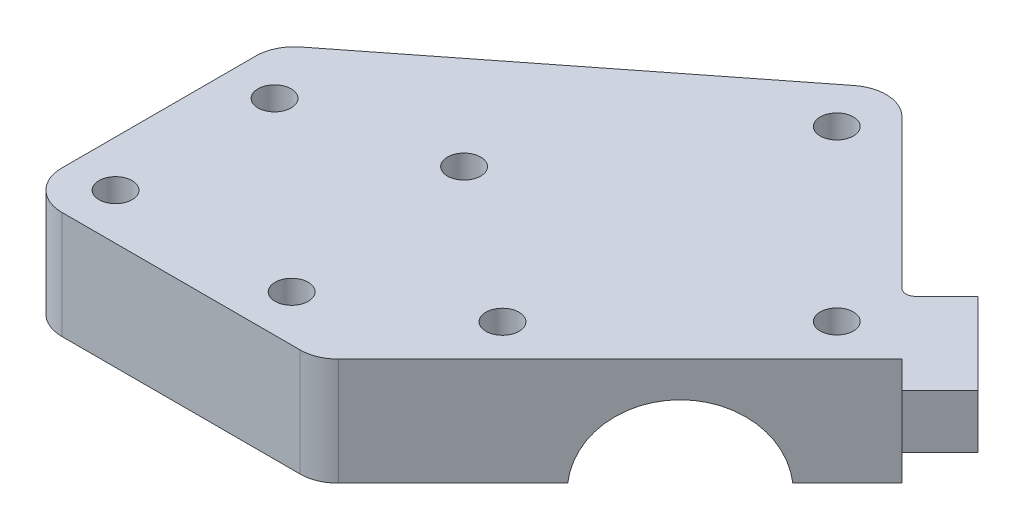
ISO-10303-21;
HEADER;
FILE_DESCRIPTION(('STEP AP214'),'2;1');
FILE_NAME('part.step','',(''),(''),'','','');
FILE_SCHEMA(('AUTOMOTIVE_DESIGN { 1 0 10303 214 1 1 1 1 }'));
ENDSEC;
DATA;
#1=APPLICATION_CONTEXT('core data for automotive mechanical design processes');
#2=APPLICATION_PROTOCOL_DEFINITION('international standard','automotive_design',2000,#1);
#3=PRODUCT_CONTEXT('',#1,'mechanical');
#4=PRODUCT('Part','Part','',(#3));
#5=PRODUCT_RELATED_PRODUCT_CATEGORY('part','',(#4));
#6=PRODUCT_DEFINITION_FORMATION('','',#4);
#7=PRODUCT_DEFINITION_CONTEXT('part definition',#1,'design');
#8=PRODUCT_DEFINITION('design','',#6,#7);
#9=PRODUCT_DEFINITION_SHAPE('','',#8);
#10=(LENGTH_UNIT() NAMED_UNIT(*) SI_UNIT(.MILLI.,.METRE.));
#11=(NAMED_UNIT(*) PLANE_ANGLE_UNIT() SI_UNIT($,.RADIAN.));
#12=(NAMED_UNIT(*) SI_UNIT($,.STERADIAN.) SOLID_ANGLE_UNIT());
#13=UNCERTAINTY_MEASURE_WITH_UNIT(LENGTH_MEASURE(1.E-05),#10,'distance_accuracy_value','');
#14=(GEOMETRIC_REPRESENTATION_CONTEXT(3) GLOBAL_UNCERTAINTY_ASSIGNED_CONTEXT((#13)) GLOBAL_UNIT_ASSIGNED_CONTEXT((#10,
#11,#12)) REPRESENTATION_CONTEXT('',''));
#15=CARTESIAN_POINT('',(0.,0.,0.));
#16=DIRECTION('',(0.,0.,1.));
#17=DIRECTION('',(1.,0.,0.));
#18=AXIS2_PLACEMENT_3D('',#15,#16,#17);
#19=CARTESIAN_POINT('',(-41.0289321881345,15.,-16.3499999999999));
#20=DIRECTION('',(-0.617406762156341,0.,-0.78664406820596));
#21=DIRECTION('',(-0.78664406820596,0.,0.617406762156341));
#22=AXIS2_PLACEMENT_3D('',#19,#20,#21);
#23=PLANE('',#22);
#24=DIRECTION('',(0.78664406820596,0.,-0.617406762156341));
#25=VECTOR('',#24,1.);
#26=CARTESIAN_POINT('',(-41.0289321881345,1.,-16.3499999999999));
#27=LINE('',#26,#25);
#28=CARTESIAN_POINT('',(-39.1159659989162,1.,-17.8514138016617));
#29=VERTEX_POINT('',#28);
#30=CARTESIAN_POINT('',(1.25585463277242,1.,-49.5377075983135));
#31=VERTEX_POINT('',#30);
#32=EDGE_CURVE('E229',#29,#31,#27,.T.);
#33=ORIENTED_EDGE('',*,*,#32,.F.);
#34=DIRECTION('',(0.,-1.,0.));
#35=VECTOR('',#34,1.);
#36=CARTESIAN_POINT('',(-39.1159659989162,15.,-17.8514138016617));
#37=LINE('',#36,#35);
#38=CARTESIAN_POINT('',(-39.1159659989162,15.,-17.8514138016617));
#39=VERTEX_POINT('',#38);
#40=EDGE_CURVE('E299',#29,#39,#37,.F.);
#41=ORIENTED_EDGE('',*,*,#40,.T.);
#42=DIRECTION('',(0.78664406820596,0.,-0.617406762156341));
#43=VECTOR('',#42,1.);
#44=CARTESIAN_POINT('',(-41.0289321881345,15.,-16.3499999999999));
#45=LINE('',#44,#43);
#46=CARTESIAN_POINT('',(1.25585463277242,15.,-49.5377075983135));
#47=VERTEX_POINT('',#46);
#48=EDGE_CURVE('E234',#39,#47,#45,.T.);
#49=ORIENTED_EDGE('',*,*,#48,.T.);
#50=DIRECTION('',(0.,-1.,0.));
#51=VECTOR('',#50,1.);
#52=CARTESIAN_POINT('',(1.25585463277243,15.,-49.5377075983135));
#53=LINE('',#52,#51);
#54=EDGE_CURVE('E296',#47,#31,#53,.T.);
#55=ORIENTED_EDGE('',*,*,#54,.T.);
#56=EDGE_LOOP('',(#33,#41,#49,#55));
#57=FACE_BOUND('',#56,.T.);
#58=ADVANCED_FACE('F36',(#57),#23,.T.);
#59=CARTESIAN_POINT('',(-41.0289321881345,15.,16.35));
#60=DIRECTION('',(-1.,0.,0.));
#61=DIRECTION('',(0.,0.,1.));
#62=AXIS2_PLACEMENT_3D('',#59,#60,#61);
#63=PLANE('',#62);
#64=DIRECTION('',(0.,0.,-1.));
#65=VECTOR('',#64,1.);
#66=CARTESIAN_POINT('',(-41.0289321881345,1.,16.35));
#67=LINE('',#66,#65);
#68=CARTESIAN_POINT('',(-41.0289321881345,1.,11.35));
#69=VERTEX_POINT('',#68);
#70=CARTESIAN_POINT('',(-41.0289321881345,1.,6.27076550350908));
#71=VERTEX_POINT('',#70);
#72=EDGE_CURVE('E187',#69,#71,#67,.T.);
#73=ORIENTED_EDGE('',*,*,#72,.F.);
#74=DIRECTION('',(0.,-1.,0.));
#75=VECTOR('',#74,1.);
#76=CARTESIAN_POINT('',(-41.0289321881345,15.,11.35));
#77=LINE('',#76,#75);
#78=CARTESIAN_POINT('',(-41.0289321881345,15.,11.35));
#79=VERTEX_POINT('',#78);
#80=EDGE_CURVE('E294',#69,#79,#77,.F.);
#81=ORIENTED_EDGE('',*,*,#80,.T.);
#82=DIRECTION('',(0.,0.,-1.));
#83=VECTOR('',#82,1.);
#84=CARTESIAN_POINT('',(-41.0289321881345,15.,16.35));
#85=LINE('',#84,#83);
#86=CARTESIAN_POINT('',(-41.0289321881345,15.,-13.9181934606319));
#87=VERTEX_POINT('',#86);
#88=EDGE_CURVE('E246',#79,#87,#85,.T.);
#89=ORIENTED_EDGE('',*,*,#88,.T.);
#90=DIRECTION('',(0.,-1.,0.));
#91=VECTOR('',#90,1.);
#92=CARTESIAN_POINT('',(-41.0289321881345,15.,-13.9181934606319));
#93=LINE('',#92,#91);
#94=CARTESIAN_POINT('',(-41.0289321881345,1.,-13.9181934606319));
#95=VERTEX_POINT('',#94);
#96=EDGE_CURVE('E291',#87,#95,#93,.T.);
#97=ORIENTED_EDGE('',*,*,#96,.T.);
#98=CARTESIAN_POINT('',(-41.0289321881345,0.999999999999998,-6.27076550350907));
#99=VERTEX_POINT('',#98);
#100=EDGE_CURVE('E262',#99,#95,#67,.T.);
#101=ORIENTED_EDGE('',*,*,#100,.F.);
#102=CARTESIAN_POINT('',(-41.0289321881345,0.,0.));
#103=DIRECTION('',(-1.,0.,0.));
#104=DIRECTION('',(0.,0.,1.));
#105=AXIS2_PLACEMENT_3D('',#102,#103,#104);
#106=CIRCLE('',#105,6.34999999999995);
#107=EDGE_CURVE('E179',#71,#99,#106,.T.);
#108=ORIENTED_EDGE('',*,*,#107,.F.);
#109=EDGE_LOOP('',(#73,#81,#89,#97,#101,#108));
#110=FACE_BOUND('',#109,.T.);
#111=ADVANCED_FACE('F361',(#110),#63,.T.);
#112=CARTESIAN_POINT('',(-2.92893218813456,15.,16.35));
#113=DIRECTION('',(0.,0.,1.));
#114=DIRECTION('',(1.,0.,0.));
#115=AXIS2_PLACEMENT_3D('',#112,#113,#114);
#116=PLANE('',#115);
#117=DIRECTION('',(-1.,0.,0.));
#118=VECTOR('',#117,1.);
#119=CARTESIAN_POINT('',(-2.92893218813456,1.,16.35));
#120=LINE('',#119,#118);
#121=CARTESIAN_POINT('',(-5.00000000000003,1.,16.35));
#122=VERTEX_POINT('',#121);
#123=CARTESIAN_POINT('',(-36.0289321881345,1.,16.35));
#124=VERTEX_POINT('',#123);
#125=EDGE_CURVE('E259',#122,#124,#120,.T.);
#126=ORIENTED_EDGE('',*,*,#125,.F.);
#127=DIRECTION('',(0.,-1.,0.));
#128=VECTOR('',#127,1.);
#129=CARTESIAN_POINT('',(-5.00000000000003,15.,16.35));
#130=LINE('',#129,#128);
#131=CARTESIAN_POINT('',(-5.00000000000003,15.,16.35));
#132=VERTEX_POINT('',#131);
#133=EDGE_CURVE('E281',#122,#132,#130,.F.);
#134=ORIENTED_EDGE('',*,*,#133,.T.);
#135=DIRECTION('',(-1.,0.,0.));
#136=VECTOR('',#135,1.);
#137=CARTESIAN_POINT('',(-2.92893218813456,15.,16.35));
#138=LINE('',#137,#136);
#139=CARTESIAN_POINT('',(-36.0289321881345,15.,16.35));
#140=VERTEX_POINT('',#139);
#141=EDGE_CURVE('E243',#132,#140,#138,.T.);
#142=ORIENTED_EDGE('',*,*,#141,.T.);
#143=DIRECTION('',(0.,-1.,0.));
#144=VECTOR('',#143,1.);
#145=CARTESIAN_POINT('',(-36.0289321881345,15.,16.35));
#146=LINE('',#145,#144);
#147=EDGE_CURVE('E278',#140,#124,#146,.T.);
#148=ORIENTED_EDGE('',*,*,#147,.T.);
#149=EDGE_LOOP('',(#126,#134,#142,#148));
#150=FACE_BOUND('',#149,.T.);
#151=ADVANCED_FACE('F354',(#150),#116,.T.);
#152=CARTESIAN_POINT('',(35.2197556622844,15.,-21.7986878504189));
#153=DIRECTION('',(0.707106781186547,0.,0.707106781186548));
#154=DIRECTION('',(0.707106781186548,0.,-0.707106781186547));
#155=AXIS2_PLACEMENT_3D('',#152,#153,#154);
#156=PLANE('',#155);
#157=DIRECTION('',(-0.707106781186548,0.,0.707106781186547));
#158=VECTOR('',#157,1.);
#159=CARTESIAN_POINT('',(35.2197556622844,15.,-21.7986878504189));
#160=LINE('',#159,#158);
#161=CARTESIAN_POINT('',(35.2197556622844,15.,-21.7986878504188));
#162=VERTEX_POINT('',#161);
#163=CARTESIAN_POINT('',(-1.46446609406729,15.,14.8855339059327));
#164=VERTEX_POINT('',#163);
#165=EDGE_CURVE('E240',#162,#164,#160,.T.);
#166=ORIENTED_EDGE('',*,*,#165,.T.);
#167=DIRECTION('',(0.,-1.,0.));
#168=VECTOR('',#167,1.);
#169=CARTESIAN_POINT('',(-1.46446609406729,15.,14.8855339059327));
#170=LINE('',#169,#168);
#171=CARTESIAN_POINT('',(-1.46446609406729,1.,14.8855339059327));
#172=VERTEX_POINT('',#171);
#173=EDGE_CURVE('E267',#164,#172,#170,.T.);
#174=ORIENTED_EDGE('',*,*,#173,.T.);
#175=DIRECTION('',(-0.707106781186548,0.,0.707106781186547));
#176=VECTOR('',#175,1.);
#177=CARTESIAN_POINT('',(35.2197556622844,1.,-21.7986878504189));
#178=LINE('',#177,#176);
#179=CARTESIAN_POINT('',(13.4550962518595,0.999999999999969,-0.0340284399940839));
#180=VERTEX_POINT('',#179);
#181=EDGE_CURVE('E255',#180,#172,#178,.T.);
#182=ORIENTED_EDGE('',*,*,#181,.F.);
#183=CARTESIAN_POINT('',(20.7848778311425,0.,-7.36381001927702));
#184=DIRECTION('',(0.707106781186547,0.,0.707106781186548));
#185=DIRECTION('',(0.707106781186548,0.,-0.707106781186547));
#186=AXIS2_PLACEMENT_3D('',#183,#184,#185);
#187=CIRCLE('',#186,10.4139999999997);
#188=CARTESIAN_POINT('',(28.1146594104257,1.,-14.6935915985602));
#189=VERTEX_POINT('',#188);
#190=EDGE_CURVE('E188',#189,#180,#187,.T.);
#191=ORIENTED_EDGE('',*,*,#190,.F.);
#192=CARTESIAN_POINT('',(35.2197556622844,1.,-21.7986878504189));
#193=VERTEX_POINT('',#192);
#194=EDGE_CURVE('E256',#193,#189,#178,.T.);
#195=ORIENTED_EDGE('',*,*,#194,.F.);
#196=DIRECTION('',(0.,-1.,0.));
#197=VECTOR('',#196,1.);
#198=CARTESIAN_POINT('',(35.2197556622844,15.,-21.7986878504189));
#199=LINE('',#198,#197);
#200=CARTESIAN_POINT('',(35.2197556622844,6.73,-21.7986878504189));
#201=VERTEX_POINT('',#200);
#202=EDGE_CURVE('E249',#201,#193,#199,.T.);
#203=ORIENTED_EDGE('',*,*,#202,.F.);
#204=CARTESIAN_POINT('',(36.1177812743913,6.73,-22.6967134625258));
#205=DIRECTION('',(0.707106781186547,0.,0.707106781186548));
#206=DIRECTION('',(0.707106781186548,0.,-0.707106781186547));
#207=AXIS2_PLACEMENT_3D('',#204,#205,#206);
#208=CIRCLE('',#207,1.27);
#209=CARTESIAN_POINT('',(36.1177812743913,8.,-22.6967134625258));
#210=VERTEX_POINT('',#209);
#211=EDGE_CURVE('E44',#201,#210,#208,.F.);
#212=ORIENTED_EDGE('',*,*,#211,.T.);
#213=DIRECTION('',(0.707106781186548,0.,-0.707106781186547));
#214=VECTOR('',#213,1.);
#215=CARTESIAN_POINT('',(6.71053390593272,8.,6.71053390593273));
#216=LINE('',#215,#214);
#217=CARTESIAN_POINT('',(35.2197556622844,8.,-21.7986878504189));
#218=VERTEX_POINT('',#217);
#219=EDGE_CURVE('E51',#218,#210,#216,.T.);
#220=ORIENTED_EDGE('',*,*,#219,.F.);
#221=EDGE_CURVE('E264',#162,#218,#199,.T.);
#222=ORIENTED_EDGE('',*,*,#221,.F.);
#223=EDGE_LOOP('',(#166,#174,#182,#191,#195,#203,#212,#220,#222));
#224=FACE_BOUND('',#223,.T.);
#225=ADVANCED_FACE('F345',(#224),#156,.T.);
#226=CARTESIAN_POINT('',(4.74345339314427,15.,-52.2749901195591));
#227=DIRECTION('',(0.707106781186548,0.,-0.707106781186547));
#228=DIRECTION('',(-0.707106781186547,0.,-0.707106781186548));
#229=AXIS2_PLACEMENT_3D('',#226,#227,#228);
#230=PLANE('',#229);
#231=DIRECTION('',(0.,1.,0.));
#232=VECTOR('',#231,1.);
#233=CARTESIAN_POINT('',(27.250662238312,8.,-29.7677812743913));
#234=LINE('',#233,#232);
#235=CARTESIAN_POINT('',(27.250662238312,15.,-29.7677812743913));
#236=VERTEX_POINT('',#235);
#237=CARTESIAN_POINT('',(27.250662238312,6.73,-29.7677812743913));
#238=VERTEX_POINT('',#237);
#239=EDGE_CURVE('E306',#236,#238,#234,.F.);
#240=ORIENTED_EDGE('',*,*,#239,.T.);
#241=DIRECTION('',(0.707106781186547,0.,0.707106781186548));
#242=VECTOR('',#241,1.);
#243=CARTESIAN_POINT('',(4.74345339314427,6.73,-52.2749901195591));
#244=LINE('',#243,#242);
#245=EDGE_CURVE('E310',#238,#201,#244,.T.);
#246=ORIENTED_EDGE('',*,*,#245,.T.);
#247=ORIENTED_EDGE('',*,*,#202,.T.);
#248=DIRECTION('',(0.707106781186547,0.,0.707106781186548));
#249=VECTOR('',#248,1.);
#250=CARTESIAN_POINT('',(4.74345339314427,1.,-52.2749901195591));
#251=LINE('',#250,#249);
#252=CARTESIAN_POINT('',(7.87842234948687,1.,-49.1400211632165));
#253=VERTEX_POINT('',#252);
#254=EDGE_CURVE('E252',#253,#193,#251,.T.);
#255=ORIENTED_EDGE('',*,*,#254,.F.);
#256=DIRECTION('',(0.,-1.,0.));
#257=VECTOR('',#256,1.);
#258=CARTESIAN_POINT('',(7.87842234948687,15.,-49.1400211632165));
#259=LINE('',#258,#257);
#260=CARTESIAN_POINT('',(7.87842234948687,15.,-49.1400211632165));
#261=VERTEX_POINT('',#260);
#262=EDGE_CURVE('E301',#253,#261,#259,.F.);
#263=ORIENTED_EDGE('',*,*,#262,.T.);
#264=DIRECTION('',(0.707106781186547,0.,0.707106781186548));
#265=VECTOR('',#264,1.);
#266=CARTESIAN_POINT('',(4.74345339314427,15.,-52.2749901195591));
#267=LINE('',#266,#265);
#268=EDGE_CURVE('E237',#261,#236,#267,.T.);
#269=ORIENTED_EDGE('',*,*,#268,.T.);
#270=EDGE_LOOP('',(#240,#246,#247,#255,#263,#269));
#271=FACE_BOUND('',#270,.T.);
#272=ADVANCED_FACE('F415',(#271),#230,.T.);
#273=CARTESIAN_POINT('',(0.,15.,0.));
#274=DIRECTION('',(0.,-1.,0.));
#275=DIRECTION('',(0.,0.,-1.));
#276=AXIS2_PLACEMENT_3D('',#273,#274,#275);
#277=PLANE('',#276);
#278=CARTESIAN_POINT('',(-35.0289321881345,15.,10.35));
#279=DIRECTION('',(0.,1.,0.));
#280=DIRECTION('',(0.,0.,1.));
#281=AXIS2_PLACEMENT_3D('',#278,#279,#280);
#282=CIRCLE('',#281,2.15899999999999);
#283=CARTESIAN_POINT('',(-35.0289321881345,15.,12.509));
#284=VERTEX_POINT('',#283);
#285=EDGE_CURVE('E407',#284,#284,#282,.T.);
#286=ORIENTED_EDGE('',*,*,#285,.F.);
#287=EDGE_LOOP('',(#286));
#288=FACE_BOUND('',#287,.T.);
#289=CARTESIAN_POINT('',(5.,15.,0.));
#290=DIRECTION('',(0.,1.,0.));
#291=DIRECTION('',(0.,0.,1.));
#292=AXIS2_PLACEMENT_3D('',#289,#290,#291);
#293=CIRCLE('',#292,2.15899999999999);
#294=CARTESIAN_POINT('',(5.,15.,2.15899999999999));
#295=VERTEX_POINT('',#294);
#296=EDGE_CURVE('E401',#295,#295,#293,.T.);
#297=ORIENTED_EDGE('',*,*,#296,.F.);
#298=EDGE_LOOP('',(#297));
#299=FACE_BOUND('',#298,.T.);
#300=CARTESIAN_POINT('',(-15.,15.,-15.));
#301=DIRECTION('',(0.,1.,0.));
#302=DIRECTION('',(0.,0.,1.));
#303=AXIS2_PLACEMENT_3D('',#300,#301,#302);
#304=CIRCLE('',#303,2.15899999999999);
#305=CARTESIAN_POINT('',(-15.,15.,-12.841));
#306=VERTEX_POINT('',#305);
#307=EDGE_CURVE('E395',#306,#306,#304,.T.);
#308=ORIENTED_EDGE('',*,*,#307,.F.);
#309=EDGE_LOOP('',(#308));
#310=FACE_BOUND('',#309,.T.);
#311=CARTESIAN_POINT('',(-12.1030431086579,15.,10.35));
#312=DIRECTION('',(0.,1.,0.));
#313=DIRECTION('',(0.,0.,1.));
#314=AXIS2_PLACEMENT_3D('',#311,#312,#313);
#315=CIRCLE('',#314,2.15899999999999);
#316=CARTESIAN_POINT('',(-12.1030431086579,15.,12.509));
#317=VERTEX_POINT('',#316);
#318=EDGE_CURVE('E389',#317,#317,#315,.T.);
#319=ORIENTED_EDGE('',*,*,#318,.F.);
#320=EDGE_LOOP('',(#319));
#321=FACE_BOUND('',#320,.T.);
#322=CARTESIAN_POINT('',(-35.0289321881345,15.,-10.35));
#323=DIRECTION('',(0.,1.,0.));
#324=DIRECTION('',(0.,0.,1.));
#325=AXIS2_PLACEMENT_3D('',#322,#323,#324);
#326=CIRCLE('',#325,2.15899999999999);
#327=CARTESIAN_POINT('',(-35.0289321881345,15.,-8.19100000000001));
#328=VERTEX_POINT('',#327);
#329=EDGE_CURVE('E383',#328,#328,#326,.T.);
#330=ORIENTED_EDGE('',*,*,#329,.F.);
#331=EDGE_LOOP('',(#330));
#332=FACE_BOUND('',#331,.T.);
#333=CARTESIAN_POINT('',(4.74345339314418,15.,-43.7897087453206));
#334=DIRECTION('',(0.,1.,0.));
#335=DIRECTION('',(0.,0.,1.));
#336=AXIS2_PLACEMENT_3D('',#333,#334,#335);
#337=CIRCLE('',#336,2.15899999999999);
#338=CARTESIAN_POINT('',(4.74345339314418,15.,-41.6307087453206));
#339=VERTEX_POINT('',#338);
#340=EDGE_CURVE('E377',#339,#339,#337,.T.);
#341=ORIENTED_EDGE('',*,*,#340,.F.);
#342=EDGE_LOOP('',(#341));
#343=FACE_BOUND('',#342,.T.);
#344=CARTESIAN_POINT('',(26.7344742880458,15.,-21.7986878504189));
#345=DIRECTION('',(0.,1.,0.));
#346=DIRECTION('',(0.,0.,1.));
#347=AXIS2_PLACEMENT_3D('',#344,#345,#346);
#348=CIRCLE('',#347,2.15899999999999);
#349=CARTESIAN_POINT('',(26.7344742880458,15.,-19.6396878504189));
#350=VERTEX_POINT('',#349);
#351=EDGE_CURVE('E367',#350,#350,#348,.T.);
#352=ORIENTED_EDGE('',*,*,#351,.F.);
#353=EDGE_LOOP('',(#352));
#354=FACE_BOUND('',#353,.T.);
#355=ORIENTED_EDGE('',*,*,#141,.F.);
#356=CARTESIAN_POINT('',(-5.00000000000003,15.,11.35));
#357=DIRECTION('',(0.,-1.,0.));
#358=DIRECTION('',(0.,0.,-1.));
#359=AXIS2_PLACEMENT_3D('',#356,#357,#358);
#360=CIRCLE('',#359,5.);
#361=EDGE_CURVE('E289',#132,#164,#360,.F.);
#362=ORIENTED_EDGE('',*,*,#361,.T.);
#363=ORIENTED_EDGE('',*,*,#165,.F.);
#364=DIRECTION('',(0.707106781186547,0.,0.707106781186547));
#365=VECTOR('',#364,1.);
#366=CARTESIAN_POINT('',(35.2197556622843,15.,-21.7986878504189));
#367=LINE('',#366,#365);
#368=CARTESIAN_POINT('',(38.755289568217,15.,-18.2631539444862));
#369=VERTEX_POINT('',#368);
#370=EDGE_CURVE('E202',#162,#369,#367,.T.);
#371=ORIENTED_EDGE('',*,*,#370,.T.);
#372=DIRECTION('',(0.707106781186547,0.,-0.707106781186548));
#373=VECTOR('',#372,1.);
#374=CARTESIAN_POINT('',(38.755289568217,15.,-18.2631539444862));
#375=LINE('',#374,#373);
#376=CARTESIAN_POINT('',(43.7050370365229,15.,-23.2129014127921));
#377=VERTEX_POINT('',#376);
#378=EDGE_CURVE('E219',#369,#377,#375,.T.);
#379=ORIENTED_EDGE('',*,*,#378,.T.);
#380=DIRECTION('',(-0.707106781186547,0.,-0.707106781186548));
#381=VECTOR('',#380,1.);
#382=CARTESIAN_POINT('',(43.7050370365229,15.,-23.2129014127921));
#383=LINE('',#382,#381);
#384=CARTESIAN_POINT('',(33.0984353187248,15.,-33.8195031305902));
#385=VERTEX_POINT('',#384);
#386=EDGE_CURVE('E222',#377,#385,#383,.T.);
#387=ORIENTED_EDGE('',*,*,#386,.T.);
#388=DIRECTION('',(-0.707106781186547,0.,0.707106781186548));
#389=VECTOR('',#388,1.);
#390=CARTESIAN_POINT('',(33.0984353187248,15.,-33.8195031305902));
#391=LINE('',#390,#389);
#392=CARTESIAN_POINT('',(29.0467134625259,15.,-29.7677812743913));
#393=VERTEX_POINT('',#392);
#394=EDGE_CURVE('E208',#385,#393,#391,.T.);
#395=ORIENTED_EDGE('',*,*,#394,.T.);
#396=CARTESIAN_POINT('',(28.148687850419,15.,-30.6658068864982));
#397=DIRECTION('',(0.,-1.,0.));
#398=DIRECTION('',(0.,0.,-1.));
#399=AXIS2_PLACEMENT_3D('',#396,#397,#398);
#400=CIRCLE('',#399,1.27);
#401=EDGE_CURVE('E308',#393,#236,#400,.T.);
#402=ORIENTED_EDGE('',*,*,#401,.T.);
#403=ORIENTED_EDGE('',*,*,#268,.F.);
#404=CARTESIAN_POINT('',(4.34288844355414,15.,-45.6044872572837));
#405=DIRECTION('',(0.,-1.,0.));
#406=DIRECTION('',(0.,0.,-1.));
#407=AXIS2_PLACEMENT_3D('',#404,#405,#406);
#408=CIRCLE('',#407,5.);
#409=EDGE_CURVE('E283',#261,#47,#408,.F.);
#410=ORIENTED_EDGE('',*,*,#409,.T.);
#411=ORIENTED_EDGE('',*,*,#48,.F.);
#412=CARTESIAN_POINT('',(-36.0289321881345,15.,-13.9181934606319));
#413=DIRECTION('',(0.,-1.,0.));
#414=DIRECTION('',(0.,0.,-1.));
#415=AXIS2_PLACEMENT_3D('',#412,#413,#414);
#416=CIRCLE('',#415,5.);
#417=EDGE_CURVE('E285',#39,#87,#416,.F.);
#418=ORIENTED_EDGE('',*,*,#417,.T.);
#419=ORIENTED_EDGE('',*,*,#88,.F.);
#420=CARTESIAN_POINT('',(-36.0289321881345,15.,11.35));
#421=DIRECTION('',(0.,-1.,0.));
#422=DIRECTION('',(0.,0.,-1.));
#423=AXIS2_PLACEMENT_3D('',#420,#421,#422);
#424=CIRCLE('',#423,5.);
#425=EDGE_CURVE('E287',#79,#140,#424,.F.);
#426=ORIENTED_EDGE('',*,*,#425,.T.);
#427=EDGE_LOOP('',(#355,#362,#363,#371,#379,#387,#395,#402,#403,#410,#411,#418,#419,#426));
#428=FACE_BOUND('',#427,.T.);
#429=ADVANCED_FACE('F332',(#288,#299,#310,#321,#332,#343,#354,#428),#277,.F.);
#430=CARTESIAN_POINT('',(0.,1.,0.));
#431=DIRECTION('',(0.,-1.,0.));
#432=DIRECTION('',(0.,0.,-1.));
#433=AXIS2_PLACEMENT_3D('',#430,#431,#432);
#434=PLANE('',#433);
#435=CARTESIAN_POINT('',(-35.0289321881345,0.999999999999973,10.35));
#436=DIRECTION('',(0.,1.,0.));
#437=DIRECTION('',(0.,0.,1.));
#438=AXIS2_PLACEMENT_3D('',#435,#436,#437);
#439=CIRCLE('',#438,2.15899999999999);
#440=CARTESIAN_POINT('',(-35.0289321881345,0.999999999999973,12.509));
#441=VERTEX_POINT('',#440);
#442=EDGE_CURVE('E404',#441,#441,#439,.T.);
#443=ORIENTED_EDGE('',*,*,#442,.T.);
#444=EDGE_LOOP('',(#443));
#445=FACE_BOUND('',#444,.T.);
#446=CARTESIAN_POINT('',(5.,0.999999999999973,0.));
#447=DIRECTION('',(0.,1.,0.));
#448=DIRECTION('',(0.,0.,1.));
#449=AXIS2_PLACEMENT_3D('',#446,#447,#448);
#450=CIRCLE('',#449,2.15899999999999);
#451=CARTESIAN_POINT('',(5.,0.999999999999973,2.15899999999999));
#452=VERTEX_POINT('',#451);
#453=EDGE_CURVE('E398',#452,#452,#450,.T.);
#454=ORIENTED_EDGE('',*,*,#453,.T.);
#455=EDGE_LOOP('',(#454));
#456=FACE_BOUND('',#455,.T.);
#457=CARTESIAN_POINT('',(-15.,0.999999999999973,-15.));
#458=DIRECTION('',(0.,1.,0.));
#459=DIRECTION('',(0.,0.,1.));
#460=AXIS2_PLACEMENT_3D('',#457,#458,#459);
#461=CIRCLE('',#460,2.15899999999999);
#462=CARTESIAN_POINT('',(-15.,0.999999999999973,-12.841));
#463=VERTEX_POINT('',#462);
#464=EDGE_CURVE('E392',#463,#463,#461,.T.);
#465=ORIENTED_EDGE('',*,*,#464,.T.);
#466=EDGE_LOOP('',(#465));
#467=FACE_BOUND('',#466,.T.);
#468=CARTESIAN_POINT('',(-12.1030431086579,0.999999999999973,10.35));
#469=DIRECTION('',(0.,1.,0.));
#470=DIRECTION('',(0.,0.,1.));
#471=AXIS2_PLACEMENT_3D('',#468,#469,#470);
#472=CIRCLE('',#471,2.15899999999999);
#473=CARTESIAN_POINT('',(-12.1030431086579,0.999999999999973,12.509));
#474=VERTEX_POINT('',#473);
#475=EDGE_CURVE('E386',#474,#474,#472,.T.);
#476=ORIENTED_EDGE('',*,*,#475,.T.);
#477=EDGE_LOOP('',(#476));
#478=FACE_BOUND('',#477,.T.);
#479=CARTESIAN_POINT('',(-35.0289321881345,0.999999999999973,-10.35));
#480=DIRECTION('',(0.,1.,0.));
#481=DIRECTION('',(0.,0.,1.));
#482=AXIS2_PLACEMENT_3D('',#479,#480,#481);
#483=CIRCLE('',#482,2.15899999999999);
#484=CARTESIAN_POINT('',(-35.0289321881345,0.999999999999973,-8.19100000000001));
#485=VERTEX_POINT('',#484);
#486=EDGE_CURVE('E380',#485,#485,#483,.T.);
#487=ORIENTED_EDGE('',*,*,#486,.T.);
#488=EDGE_LOOP('',(#487));
#489=FACE_BOUND('',#488,.T.);
#490=CARTESIAN_POINT('',(4.74345339314418,0.999999999999973,-43.7897087453206));
#491=DIRECTION('',(0.,1.,0.));
#492=DIRECTION('',(0.,0.,1.));
#493=AXIS2_PLACEMENT_3D('',#490,#491,#492);
#494=CIRCLE('',#493,2.15899999999999);
#495=CARTESIAN_POINT('',(4.74345339314418,0.999999999999973,-41.6307087453206));
#496=VERTEX_POINT('',#495);
#497=EDGE_CURVE('E372',#496,#496,#494,.T.);
#498=ORIENTED_EDGE('',*,*,#497,.T.);
#499=EDGE_LOOP('',(#498));
#500=FACE_BOUND('',#499,.T.);
#501=CARTESIAN_POINT('',(26.7344742880458,0.999999999999973,-21.7986878504189));
#502=DIRECTION('',(0.,1.,0.));
#503=DIRECTION('',(0.,0.,1.));
#504=AXIS2_PLACEMENT_3D('',#501,#502,#503);
#505=CIRCLE('',#504,2.15899999999998);
#506=CARTESIAN_POINT('',(26.7344742880458,0.999999999999973,-19.6396878504189));
#507=VERTEX_POINT('',#506);
#508=EDGE_CURVE('E365',#507,#507,#505,.T.);
#509=ORIENTED_EDGE('',*,*,#508,.T.);
#510=EDGE_LOOP('',(#509));
#511=FACE_BOUND('',#510,.T.);
#512=ORIENTED_EDGE('',*,*,#181,.T.);
#513=CARTESIAN_POINT('',(-5.00000000000003,1.,11.35));
#514=DIRECTION('',(0.,-1.,0.));
#515=DIRECTION('',(0.,0.,-1.));
#516=AXIS2_PLACEMENT_3D('',#513,#514,#515);
#517=CIRCLE('',#516,5.);
#518=EDGE_CURVE('E276',#172,#122,#517,.T.);
#519=ORIENTED_EDGE('',*,*,#518,.T.);
#520=ORIENTED_EDGE('',*,*,#125,.T.);
#521=CARTESIAN_POINT('',(-36.0289321881345,1.,11.35));
#522=DIRECTION('',(0.,-1.,0.));
#523=DIRECTION('',(0.,0.,-1.));
#524=AXIS2_PLACEMENT_3D('',#521,#522,#523);
#525=CIRCLE('',#524,5.);
#526=EDGE_CURVE('E274',#124,#69,#525,.T.);
#527=ORIENTED_EDGE('',*,*,#526,.T.);
#528=ORIENTED_EDGE('',*,*,#72,.T.);
#529=DIRECTION('',(-1.,0.,0.));
#530=VECTOR('',#529,1.);
#531=CARTESIAN_POINT('',(0.,1.,6.27076550350908));
#532=LINE('',#531,#530);
#533=CARTESIAN_POINT('',(0.,1.,6.27076550350908));
#534=VERTEX_POINT('',#533);
#535=EDGE_CURVE('E172',#534,#71,#532,.T.);
#536=ORIENTED_EDGE('',*,*,#535,.F.);
#537=DIRECTION('',(0.,0.,1.));
#538=VECTOR('',#537,1.);
#539=CARTESIAN_POINT('',(0.,0.999999999999998,-6.27076550350907));
#540=LINE('',#539,#538);
#541=CARTESIAN_POINT('',(0.,1.,-6.27076550350907));
#542=VERTEX_POINT('',#541);
#543=EDGE_CURVE('E178',#542,#534,#540,.T.);
#544=ORIENTED_EDGE('',*,*,#543,.F.);
#545=DIRECTION('',(-1.,0.,0.));
#546=VECTOR('',#545,1.);
#547=CARTESIAN_POINT('',(0.,0.999999999999998,-6.27076550350907));
#548=LINE('',#547,#546);
#549=EDGE_CURVE('E175',#542,#99,#548,.T.);
#550=ORIENTED_EDGE('',*,*,#549,.T.);
#551=ORIENTED_EDGE('',*,*,#100,.T.);
#552=CARTESIAN_POINT('',(-36.0289321881345,1.,-13.9181934606319));
#553=DIRECTION('',(0.,-1.,0.));
#554=DIRECTION('',(0.,0.,-1.));
#555=AXIS2_PLACEMENT_3D('',#552,#553,#554);
#556=CIRCLE('',#555,5.);
#557=EDGE_CURVE('E272',#95,#29,#556,.T.);
#558=ORIENTED_EDGE('',*,*,#557,.T.);
#559=ORIENTED_EDGE('',*,*,#32,.T.);
#560=CARTESIAN_POINT('',(4.34288844355414,1.,-45.6044872572837));
#561=DIRECTION('',(0.,-1.,0.));
#562=DIRECTION('',(0.,0.,-1.));
#563=AXIS2_PLACEMENT_3D('',#560,#561,#562);
#564=CIRCLE('',#563,5.);
#565=EDGE_CURVE('E270',#31,#253,#564,.T.);
#566=ORIENTED_EDGE('',*,*,#565,.T.);
#567=ORIENTED_EDGE('',*,*,#254,.T.);
#568=ORIENTED_EDGE('',*,*,#194,.T.);
#569=DIRECTION('',(0.707106781186547,0.,0.707106781186548));
#570=VECTOR('',#569,1.);
#571=CARTESIAN_POINT('',(1.17389104721818,1.,-41.6343599617677));
#572=LINE('',#571,#570);
#573=CARTESIAN_POINT('',(1.17389104721818,1.,-41.6343599617677));
#574=VERTEX_POINT('',#573);
#575=EDGE_CURVE('E200',#574,#189,#572,.T.);
#576=ORIENTED_EDGE('',*,*,#575,.F.);
#577=DIRECTION('',(0.707106781186548,0.,-0.707106781186547));
#578=VECTOR('',#577,1.);
#579=CARTESIAN_POINT('',(-13.4856721113479,0.999999999999969,-26.9747968032016));
#580=LINE('',#579,#578);
#581=CARTESIAN_POINT('',(-13.4856721113479,1.,-26.9747968032016));
#582=VERTEX_POINT('',#581);
#583=EDGE_CURVE('E196',#582,#574,#580,.T.);
#584=ORIENTED_EDGE('',*,*,#583,.F.);
#585=DIRECTION('',(0.707106781186547,0.,0.707106781186548));
#586=VECTOR('',#585,1.);
#587=CARTESIAN_POINT('',(-13.4856721113479,0.999999999999969,-26.9747968032016));
#588=LINE('',#587,#586);
#589=EDGE_CURVE('E198',#582,#180,#588,.T.);
#590=ORIENTED_EDGE('',*,*,#589,.T.);
#591=EDGE_LOOP('',(#512,#519,#520,#527,#528,#536,#544,#550,#551,#558,#559,#566,#567,#568,#576,
#584,#590));
#592=FACE_BOUND('',#591,.T.);
#593=ADVANCED_FACE('F185',(#445,#456,#467,#478,#489,#500,#511,#592),#434,.T.);
#594=CARTESIAN_POINT('',(33.0984353187248,8.,-33.8195031305902));
#595=DIRECTION('',(-0.707106781186548,0.,-0.707106781186547));
#596=DIRECTION('',(-0.707106781186547,0.,0.707106781186548));
#597=AXIS2_PLACEMENT_3D('',#594,#595,#596);
#598=PLANE('',#597);
#599=DIRECTION('',(-0.707106781186547,0.,0.707106781186548));
#600=VECTOR('',#599,1.);
#601=CARTESIAN_POINT('',(33.0984353187248,8.,-33.8195031305902));
#602=LINE('',#601,#600);
#603=CARTESIAN_POINT('',(33.0984353187248,8.,-33.8195031305902));
#604=VERTEX_POINT('',#603);
#605=CARTESIAN_POINT('',(29.0467134625259,8.,-29.7677812743913));
#606=VERTEX_POINT('',#605);
#607=EDGE_CURVE('E214',#604,#606,#602,.T.);
#608=ORIENTED_EDGE('',*,*,#607,.T.);
#609=DIRECTION('',(0.,1.,0.));
#610=VECTOR('',#609,1.);
#611=CARTESIAN_POINT('',(29.0467134625259,15.,-29.7677812743913));
#612=LINE('',#611,#610);
#613=EDGE_CURVE('E303',#606,#393,#612,.T.);
#614=ORIENTED_EDGE('',*,*,#613,.T.);
#615=ORIENTED_EDGE('',*,*,#394,.F.);
#616=DIRECTION('',(0.,1.,0.));
#617=VECTOR('',#616,1.);
#618=CARTESIAN_POINT('',(33.0984353187248,8.,-33.8195031305902));
#619=LINE('',#618,#617);
#620=EDGE_CURVE('E227',#604,#385,#619,.T.);
#621=ORIENTED_EDGE('',*,*,#620,.F.);
#622=EDGE_LOOP('',(#608,#614,#615,#621));
#623=FACE_BOUND('',#622,.T.);
#624=ADVANCED_FACE('F329',(#623),#598,.T.);
#625=CARTESIAN_POINT('',(43.7050370365229,8.,-23.2129014127921));
#626=DIRECTION('',(0.707106781186548,0.,-0.707106781186547));
#627=DIRECTION('',(-0.707106781186547,0.,-0.707106781186548));
#628=AXIS2_PLACEMENT_3D('',#625,#626,#627);
#629=PLANE('',#628);
#630=ORIENTED_EDGE('',*,*,#386,.F.);
#631=DIRECTION('',(0.,1.,0.));
#632=VECTOR('',#631,1.);
#633=CARTESIAN_POINT('',(43.7050370365229,8.,-23.2129014127921));
#634=LINE('',#633,#632);
#635=CARTESIAN_POINT('',(43.7050370365229,8.,-23.2129014127921));
#636=VERTEX_POINT('',#635);
#637=EDGE_CURVE('E230',#636,#377,#634,.T.);
#638=ORIENTED_EDGE('',*,*,#637,.F.);
#639=DIRECTION('',(-0.707106781186547,0.,-0.707106781186548));
#640=VECTOR('',#639,1.);
#641=CARTESIAN_POINT('',(43.7050370365229,8.,-23.2129014127921));
#642=LINE('',#641,#640);
#643=EDGE_CURVE('E211',#636,#604,#642,.T.);
#644=ORIENTED_EDGE('',*,*,#643,.T.);
#645=ORIENTED_EDGE('',*,*,#620,.T.);
#646=EDGE_LOOP('',(#630,#638,#644,#645));
#647=FACE_BOUND('',#646,.T.);
#648=ADVANCED_FACE('F337',(#647),#629,.T.);
#649=CARTESIAN_POINT('',(38.755289568217,8.,-18.2631539444862));
#650=DIRECTION('',(0.707106781186548,0.,0.707106781186547));
#651=DIRECTION('',(0.707106781186547,0.,-0.707106781186548));
#652=AXIS2_PLACEMENT_3D('',#649,#650,#651);
#653=PLANE('',#652);
#654=ORIENTED_EDGE('',*,*,#378,.F.);
#655=DIRECTION('',(0.,1.,0.));
#656=VECTOR('',#655,1.);
#657=CARTESIAN_POINT('',(38.755289568217,8.,-18.2631539444862));
#658=LINE('',#657,#656);
#659=CARTESIAN_POINT('',(38.755289568217,8.,-18.2631539444862));
#660=VERTEX_POINT('',#659);
#661=EDGE_CURVE('E217',#660,#369,#658,.T.);
#662=ORIENTED_EDGE('',*,*,#661,.F.);
#663=DIRECTION('',(0.707106781186547,0.,-0.707106781186548));
#664=VECTOR('',#663,1.);
#665=CARTESIAN_POINT('',(38.755289568217,8.,-18.2631539444862));
#666=LINE('',#665,#664);
#667=EDGE_CURVE('E207',#660,#636,#666,.T.);
#668=ORIENTED_EDGE('',*,*,#667,.T.);
#669=ORIENTED_EDGE('',*,*,#637,.T.);
#670=EDGE_LOOP('',(#654,#662,#668,#669));
#671=FACE_BOUND('',#670,.T.);
#672=ADVANCED_FACE('F341',(#671),#653,.T.);
#673=CARTESIAN_POINT('',(35.2197556622843,8.,-21.7986878504189));
#674=DIRECTION('',(-0.707106781186548,0.,0.707106781186548));
#675=DIRECTION('',(0.707106781186548,0.,0.707106781186548));
#676=AXIS2_PLACEMENT_3D('',#673,#674,#675);
#677=PLANE('',#676);
#678=ORIENTED_EDGE('',*,*,#370,.F.);
#679=ORIENTED_EDGE('',*,*,#221,.T.);
#680=DIRECTION('',(0.707106781186543,0.,0.707106781186552));
#681=VECTOR('',#680,1.);
#682=CARTESIAN_POINT('',(28.1486878504189,8.,-28.8697556622843));
#683=LINE('',#682,#681);
#684=EDGE_CURVE('E205',#218,#660,#683,.T.);
#685=ORIENTED_EDGE('',*,*,#684,.T.);
#686=ORIENTED_EDGE('',*,*,#661,.T.);
#687=EDGE_LOOP('',(#678,#679,#685,#686));
#688=FACE_BOUND('',#687,.T.);
#689=ADVANCED_FACE('F344',(#688),#677,.T.);
#690=CARTESIAN_POINT('',(0.,8.,0.));
#691=DIRECTION('',(0.,1.,0.));
#692=DIRECTION('',(0.,0.,1.));
#693=AXIS2_PLACEMENT_3D('',#690,#691,#692);
#694=PLANE('',#693);
#695=ORIENTED_EDGE('',*,*,#684,.F.);
#696=ORIENTED_EDGE('',*,*,#219,.T.);
#697=DIRECTION('',(0.707106781186547,0.,0.707106781186548));
#698=VECTOR('',#697,1.);
#699=CARTESIAN_POINT('',(29.4072473684586,8.,-29.4072473684585));
#700=LINE('',#699,#698);
#701=EDGE_CURVE('E313',#210,#606,#700,.F.);
#702=ORIENTED_EDGE('',*,*,#701,.T.);
#703=ORIENTED_EDGE('',*,*,#607,.F.);
#704=ORIENTED_EDGE('',*,*,#643,.F.);
#705=ORIENTED_EDGE('',*,*,#667,.F.);
#706=EDGE_LOOP('',(#695,#696,#702,#703,#704,#705));
#707=FACE_BOUND('',#706,.T.);
#708=ADVANCED_FACE('F317',(#707),#694,.F.);
#709=CARTESIAN_POINT('',(-6.15589053206499,0.,-34.3045783824845));
#710=DIRECTION('',(0.707106781186547,0.,0.707106781186548));
#711=DIRECTION('',(0.707106781186548,0.,-0.707106781186547));
#712=AXIS2_PLACEMENT_3D('',#709,#710,#711);
#713=CYLINDRICAL_SURFACE('',#712,10.4139999999997);
#714=ORIENTED_EDGE('',*,*,#190,.T.);
#715=ORIENTED_EDGE('',*,*,#589,.F.);
#716=CARTESIAN_POINT('',(-6.15589053206499,0.,-34.3045783824845));
#717=DIRECTION('',(0.707106781186547,0.,0.707106781186548));
#718=DIRECTION('',(0.707106781186548,0.,-0.707106781186547));
#719=AXIS2_PLACEMENT_3D('',#716,#717,#718);
#720=CIRCLE('',#719,10.4139999999997);
#721=EDGE_CURVE('E190',#574,#582,#720,.T.);
#722=ORIENTED_EDGE('',*,*,#721,.F.);
#723=ORIENTED_EDGE('',*,*,#575,.T.);
#724=EDGE_LOOP('',(#714,#715,#722,#723));
#725=FACE_BOUND('',#724,.T.);
#726=ADVANCED_FACE('F484',(#725),#713,.F.);
#727=CARTESIAN_POINT('',(-6.15589053206499,0.,-34.3045783824845));
#728=DIRECTION('',(0.707106781186547,0.,0.707106781186548));
#729=DIRECTION('',(0.707106781186548,0.,-0.707106781186547));
#730=AXIS2_PLACEMENT_3D('',#727,#728,#729);
#731=PLANE('',#730);
#732=ORIENTED_EDGE('',*,*,#721,.T.);
#733=ORIENTED_EDGE('',*,*,#583,.T.);
#734=EDGE_LOOP('',(#732,#733));
#735=FACE_BOUND('',#734,.T.);
#736=ADVANCED_FACE('F643',(#735),#731,.T.);
#737=CARTESIAN_POINT('',(0.,0.,0.));
#738=DIRECTION('',(-1.,0.,0.));
#739=DIRECTION('',(0.,0.,1.));
#740=AXIS2_PLACEMENT_3D('',#737,#738,#739);
#741=CYLINDRICAL_SURFACE('',#740,6.34999999999995);
#742=ORIENTED_EDGE('',*,*,#107,.T.);
#743=ORIENTED_EDGE('',*,*,#549,.F.);
#744=CARTESIAN_POINT('',(0.,0.,0.));
#745=DIRECTION('',(-1.,0.,0.));
#746=DIRECTION('',(0.,0.,1.));
#747=AXIS2_PLACEMENT_3D('',#744,#745,#746);
#748=CIRCLE('',#747,6.34999999999995);
#749=EDGE_CURVE('E168',#534,#542,#748,.T.);
#750=ORIENTED_EDGE('',*,*,#749,.F.);
#751=ORIENTED_EDGE('',*,*,#535,.T.);
#752=EDGE_LOOP('',(#742,#743,#750,#751));
#753=FACE_BOUND('',#752,.T.);
#754=ADVANCED_FACE('F170',(#753),#741,.F.);
#755=CARTESIAN_POINT('',(0.,0.,0.));
#756=DIRECTION('',(-1.,0.,0.));
#757=DIRECTION('',(0.,0.,1.));
#758=AXIS2_PLACEMENT_3D('',#755,#756,#757);
#759=PLANE('',#758);
#760=ORIENTED_EDGE('',*,*,#749,.T.);
#761=ORIENTED_EDGE('',*,*,#543,.T.);
#762=EDGE_LOOP('',(#760,#761));
#763=FACE_BOUND('',#762,.T.);
#764=ADVANCED_FACE('F181',(#763),#759,.T.);
#765=CARTESIAN_POINT('',(26.7344742880458,15.,-21.7986878504189));
#766=DIRECTION('',(0.,1.,0.));
#767=DIRECTION('',(0.,0.,1.));
#768=AXIS2_PLACEMENT_3D('',#765,#766,#767);
#769=CYLINDRICAL_SURFACE('',#768,2.15899999999999);
#770=ORIENTED_EDGE('',*,*,#508,.F.);
#771=EDGE_LOOP('',(#770));
#772=FACE_BOUND('',#771,.T.);
#773=ORIENTED_EDGE('',*,*,#351,.T.);
#774=EDGE_LOOP('',(#773));
#775=FACE_BOUND('',#774,.T.);
#776=ADVANCED_FACE('F429',(#772,#775),#769,.F.);
#777=CARTESIAN_POINT('',(4.74345339314418,15.,-43.7897087453206));
#778=DIRECTION('',(0.,1.,0.));
#779=DIRECTION('',(0.,0.,1.));
#780=AXIS2_PLACEMENT_3D('',#777,#778,#779);
#781=CYLINDRICAL_SURFACE('',#780,2.15899999999999);
#782=ORIENTED_EDGE('',*,*,#497,.F.);
#783=EDGE_LOOP('',(#782));
#784=FACE_BOUND('',#783,.T.);
#785=ORIENTED_EDGE('',*,*,#340,.T.);
#786=EDGE_LOOP('',(#785));
#787=FACE_BOUND('',#786,.T.);
#788=ADVANCED_FACE('F431',(#784,#787),#781,.F.);
#789=CARTESIAN_POINT('',(-35.0289321881345,15.,-10.35));
#790=DIRECTION('',(0.,1.,0.));
#791=DIRECTION('',(0.,0.,1.));
#792=AXIS2_PLACEMENT_3D('',#789,#790,#791);
#793=CYLINDRICAL_SURFACE('',#792,2.15899999999999);
#794=ORIENTED_EDGE('',*,*,#486,.F.);
#795=EDGE_LOOP('',(#794));
#796=FACE_BOUND('',#795,.T.);
#797=ORIENTED_EDGE('',*,*,#329,.T.);
#798=EDGE_LOOP('',(#797));
#799=FACE_BOUND('',#798,.T.);
#800=ADVANCED_FACE('F438',(#796,#799),#793,.F.);
#801=CARTESIAN_POINT('',(-12.1030431086579,15.,10.35));
#802=DIRECTION('',(0.,1.,0.));
#803=DIRECTION('',(0.,0.,1.));
#804=AXIS2_PLACEMENT_3D('',#801,#802,#803);
#805=CYLINDRICAL_SURFACE('',#804,2.15899999999999);
#806=ORIENTED_EDGE('',*,*,#475,.F.);
#807=EDGE_LOOP('',(#806));
#808=FACE_BOUND('',#807,.T.);
#809=ORIENTED_EDGE('',*,*,#318,.T.);
#810=EDGE_LOOP('',(#809));
#811=FACE_BOUND('',#810,.T.);
#812=ADVANCED_FACE('F599',(#808,#811),#805,.F.);
#813=CARTESIAN_POINT('',(-15.,15.,-15.));
#814=DIRECTION('',(0.,1.,0.));
#815=DIRECTION('',(0.,0.,1.));
#816=AXIS2_PLACEMENT_3D('',#813,#814,#815);
#817=CYLINDRICAL_SURFACE('',#816,2.15899999999999);
#818=ORIENTED_EDGE('',*,*,#464,.F.);
#819=EDGE_LOOP('',(#818));
#820=FACE_BOUND('',#819,.T.);
#821=ORIENTED_EDGE('',*,*,#307,.T.);
#822=EDGE_LOOP('',(#821));
#823=FACE_BOUND('',#822,.T.);
#824=ADVANCED_FACE('F589',(#820,#823),#817,.F.);
#825=CARTESIAN_POINT('',(5.,15.,0.));
#826=DIRECTION('',(0.,1.,0.));
#827=DIRECTION('',(0.,0.,1.));
#828=AXIS2_PLACEMENT_3D('',#825,#826,#827);
#829=CYLINDRICAL_SURFACE('',#828,2.15899999999999);
#830=ORIENTED_EDGE('',*,*,#453,.F.);
#831=EDGE_LOOP('',(#830));
#832=FACE_BOUND('',#831,.T.);
#833=ORIENTED_EDGE('',*,*,#296,.T.);
#834=EDGE_LOOP('',(#833));
#835=FACE_BOUND('',#834,.T.);
#836=ADVANCED_FACE('F579',(#832,#835),#829,.F.);
#837=CARTESIAN_POINT('',(-35.0289321881345,15.,10.35));
#838=DIRECTION('',(0.,1.,0.));
#839=DIRECTION('',(0.,0.,1.));
#840=AXIS2_PLACEMENT_3D('',#837,#838,#839);
#841=CYLINDRICAL_SURFACE('',#840,2.15899999999999);
#842=ORIENTED_EDGE('',*,*,#442,.F.);
#843=EDGE_LOOP('',(#842));
#844=FACE_BOUND('',#843,.T.);
#845=ORIENTED_EDGE('',*,*,#285,.T.);
#846=EDGE_LOOP('',(#845));
#847=FACE_BOUND('',#846,.T.);
#848=ADVANCED_FACE('F411',(#844,#847),#841,.F.);
#849=CARTESIAN_POINT('',(-5.00000000000003,15.,11.35));
#850=DIRECTION('',(0.,-1.,0.));
#851=DIRECTION('',(0.,0.,-1.));
#852=AXIS2_PLACEMENT_3D('',#849,#850,#851);
#853=CYLINDRICAL_SURFACE('',#852,5.);
#854=ORIENTED_EDGE('',*,*,#361,.F.);
#855=ORIENTED_EDGE('',*,*,#133,.F.);
#856=ORIENTED_EDGE('',*,*,#518,.F.);
#857=ORIENTED_EDGE('',*,*,#173,.F.);
#858=EDGE_LOOP('',(#854,#855,#856,#857));
#859=FACE_BOUND('',#858,.T.);
#860=ADVANCED_FACE('F350',(#859),#853,.T.);
#861=CARTESIAN_POINT('',(-36.0289321881345,15.,11.35));
#862=DIRECTION('',(0.,-1.,0.));
#863=DIRECTION('',(0.,0.,-1.));
#864=AXIS2_PLACEMENT_3D('',#861,#862,#863);
#865=CYLINDRICAL_SURFACE('',#864,5.);
#866=ORIENTED_EDGE('',*,*,#425,.F.);
#867=ORIENTED_EDGE('',*,*,#80,.F.);
#868=ORIENTED_EDGE('',*,*,#526,.F.);
#869=ORIENTED_EDGE('',*,*,#147,.F.);
#870=EDGE_LOOP('',(#866,#867,#868,#869));
#871=FACE_BOUND('',#870,.T.);
#872=ADVANCED_FACE('F358',(#871),#865,.T.);
#873=CARTESIAN_POINT('',(-36.0289321881345,15.,-13.9181934606319));
#874=DIRECTION('',(0.,-1.,0.));
#875=DIRECTION('',(0.,0.,-1.));
#876=AXIS2_PLACEMENT_3D('',#873,#874,#875);
#877=CYLINDRICAL_SURFACE('',#876,5.);
#878=ORIENTED_EDGE('',*,*,#417,.F.);
#879=ORIENTED_EDGE('',*,*,#40,.F.);
#880=ORIENTED_EDGE('',*,*,#557,.F.);
#881=ORIENTED_EDGE('',*,*,#96,.F.);
#882=EDGE_LOOP('',(#878,#879,#880,#881));
#883=FACE_BOUND('',#882,.T.);
#884=ADVANCED_FACE('F457',(#883),#877,.T.);
#885=CARTESIAN_POINT('',(4.34288844355414,15.,-45.6044872572837));
#886=DIRECTION('',(0.,-1.,0.));
#887=DIRECTION('',(0.,0.,-1.));
#888=AXIS2_PLACEMENT_3D('',#885,#886,#887);
#889=CYLINDRICAL_SURFACE('',#888,5.);
#890=ORIENTED_EDGE('',*,*,#409,.F.);
#891=ORIENTED_EDGE('',*,*,#262,.F.);
#892=ORIENTED_EDGE('',*,*,#565,.F.);
#893=ORIENTED_EDGE('',*,*,#54,.F.);
#894=EDGE_LOOP('',(#890,#891,#892,#893));
#895=FACE_BOUND('',#894,.T.);
#896=ADVANCED_FACE('F460',(#895),#889,.T.);
#897=CARTESIAN_POINT('',(28.148687850419,8.,-30.6658068864982));
#898=DIRECTION('',(0.,-1.,0.));
#899=DIRECTION('',(0.,0.,-1.));
#900=AXIS2_PLACEMENT_3D('',#897,#898,#899);
#901=CYLINDRICAL_SURFACE('',#900,1.27);
#902=ORIENTED_EDGE('',*,*,#613,.F.);
#903=CARTESIAN_POINT('',(28.148687850419,6.73,-30.6658068864982));
#904=DIRECTION('',(0.5,-0.707106781186547,0.5));
#905=DIRECTION('',(-0.5,-0.707106781186547,-0.5));
#906=AXIS2_PLACEMENT_3D('',#903,#904,#905);
#907=ELLIPSE('',#906,1.79605122421383,1.27);
#908=EDGE_CURVE('E11',#606,#238,#907,.T.);
#909=ORIENTED_EDGE('',*,*,#908,.T.);
#910=ORIENTED_EDGE('',*,*,#239,.F.);
#911=ORIENTED_EDGE('',*,*,#401,.F.);
#912=EDGE_LOOP('',(#902,#909,#910,#911));
#913=FACE_BOUND('',#912,.T.);
#914=ADVANCED_FACE('F326',(#913),#901,.F.);
#915=CARTESIAN_POINT('',(5.64147900525119,6.73,-53.173015731666));
#916=DIRECTION('',(0.707106781186547,0.,0.707106781186548));
#917=DIRECTION('',(0.707106781186548,0.,-0.707106781186547));
#918=AXIS2_PLACEMENT_3D('',#915,#916,#917);
#919=CYLINDRICAL_SURFACE('',#918,1.27);
#920=ORIENTED_EDGE('',*,*,#908,.F.);
#921=ORIENTED_EDGE('',*,*,#701,.F.);
#922=ORIENTED_EDGE('',*,*,#211,.F.);
#923=ORIENTED_EDGE('',*,*,#245,.F.);
#924=EDGE_LOOP('',(#920,#921,#922,#923));
#925=FACE_BOUND('',#924,.T.);
#926=ADVANCED_FACE('F38',(#925),#919,.F.);
#927=CLOSED_SHELL('',(#58,#111,#151,#225,#272,#429,#593,#624,#648,#672,#689,#708,#726,#736,#754,
#764,#776,#788,#800,#812,#824,#836,#848,#860,#872,#884,#896,#914,#926));
#928=MANIFOLD_SOLID_BREP('B2',#927);
#929=ADVANCED_BREP_SHAPE_REPRESENTATION('',(#18,#928),#14);
#930=SHAPE_DEFINITION_REPRESENTATION(#9,#929);
ENDSEC;
END-ISO-10303-21;
